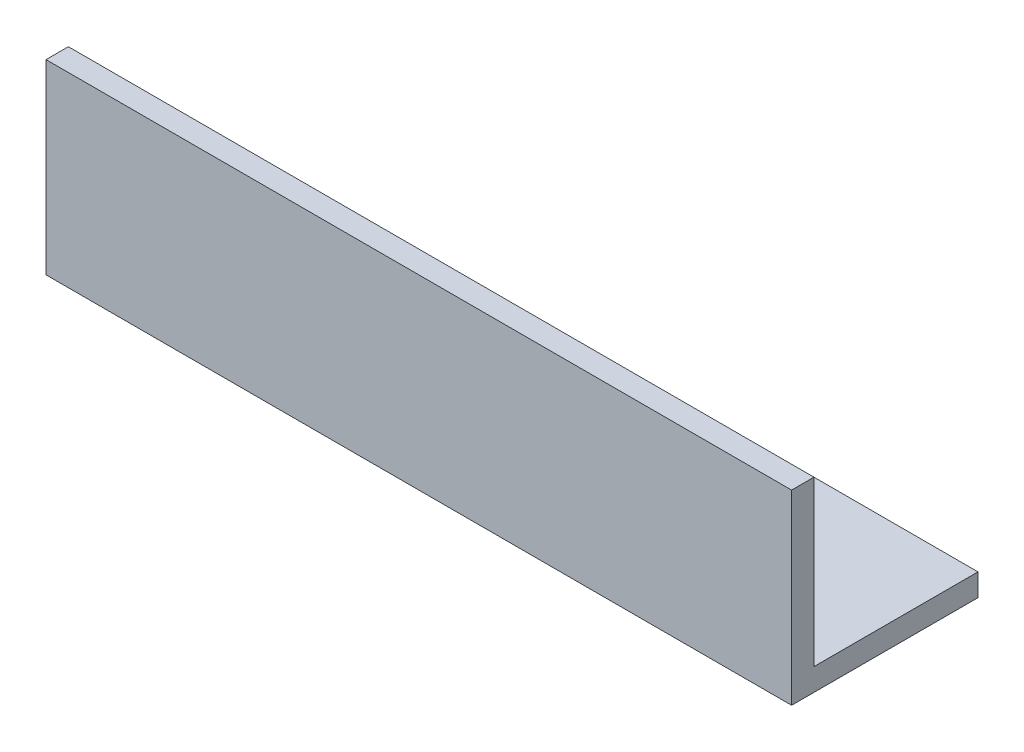
ISO-10303-21;
HEADER;
FILE_DESCRIPTION(('STEP AP214'),'2;1');
FILE_NAME('part.step','',(''),(''),'','','');
FILE_SCHEMA(('AUTOMOTIVE_DESIGN { 1 0 10303 214 1 1 1 1 }'));
ENDSEC;
DATA;
#1=APPLICATION_CONTEXT('core data for automotive mechanical design processes');
#2=APPLICATION_PROTOCOL_DEFINITION('international standard','automotive_design',2000,#1);
#3=PRODUCT_CONTEXT('',#1,'mechanical');
#4=PRODUCT('Part','Part','',(#3));
#5=PRODUCT_RELATED_PRODUCT_CATEGORY('part','',(#4));
#6=PRODUCT_DEFINITION_FORMATION('','',#4);
#7=PRODUCT_DEFINITION_CONTEXT('part definition',#1,'design');
#8=PRODUCT_DEFINITION('design','',#6,#7);
#9=PRODUCT_DEFINITION_SHAPE('','',#8);
#10=(LENGTH_UNIT() NAMED_UNIT(*) SI_UNIT(.MILLI.,.METRE.));
#11=(NAMED_UNIT(*) PLANE_ANGLE_UNIT() SI_UNIT($,.RADIAN.));
#12=(NAMED_UNIT(*) SI_UNIT($,.STERADIAN.) SOLID_ANGLE_UNIT());
#13=UNCERTAINTY_MEASURE_WITH_UNIT(LENGTH_MEASURE(1.E-05),#10,'distance_accuracy_value','');
#14=(GEOMETRIC_REPRESENTATION_CONTEXT(3) GLOBAL_UNCERTAINTY_ASSIGNED_CONTEXT((#13)) GLOBAL_UNIT_ASSIGNED_CONTEXT((#10,
#11,#12)) REPRESENTATION_CONTEXT('',''));
#15=CARTESIAN_POINT('',(0.,0.,0.));
#16=DIRECTION('',(0.,0.,1.));
#17=DIRECTION('',(1.,0.,0.));
#18=AXIS2_PLACEMENT_3D('',#15,#16,#17);
#19=CARTESIAN_POINT('',(100.,0.,0.));
#20=DIRECTION('',(0.,1.,0.));
#21=DIRECTION('',(0.,0.,1.));
#22=AXIS2_PLACEMENT_3D('',#19,#20,#21);
#23=PLANE('',#22);
#24=DIRECTION('',(0.,0.,-1.));
#25=VECTOR('',#24,1.);
#26=CARTESIAN_POINT('',(0.,0.,0.));
#27=LINE('',#26,#25);
#28=CARTESIAN_POINT('',(0.,0.,0.));
#29=VERTEX_POINT('',#28);
#30=CARTESIAN_POINT('',(0.,0.,-25.));
#31=VERTEX_POINT('',#30);
#32=EDGE_CURVE('E120',#29,#31,#27,.T.);
#33=ORIENTED_EDGE('',*,*,#32,.T.);
#34=DIRECTION('',(-1.,0.,0.));
#35=VECTOR('',#34,1.);
#36=CARTESIAN_POINT('',(100.,0.,-25.));
#37=LINE('',#36,#35);
#38=CARTESIAN_POINT('',(100.,0.,-25.));
#39=VERTEX_POINT('',#38);
#40=EDGE_CURVE('E11',#39,#31,#37,.T.);
#41=ORIENTED_EDGE('',*,*,#40,.F.);
#42=DIRECTION('',(0.,0.,-1.));
#43=VECTOR('',#42,1.);
#44=CARTESIAN_POINT('',(100.,0.,0.));
#45=LINE('',#44,#43);
#46=CARTESIAN_POINT('',(100.,0.,0.));
#47=VERTEX_POINT('',#46);
#48=EDGE_CURVE('E85',#47,#39,#45,.T.);
#49=ORIENTED_EDGE('',*,*,#48,.F.);
#50=DIRECTION('',(-1.,0.,0.));
#51=VECTOR('',#50,1.);
#52=CARTESIAN_POINT('',(100.,0.,0.));
#53=LINE('',#52,#51);
#54=EDGE_CURVE('E116',#47,#29,#53,.T.);
#55=ORIENTED_EDGE('',*,*,#54,.T.);
#56=EDGE_LOOP('',(#33,#41,#49,#55));
#57=FACE_BOUND('',#56,.T.);
#58=ADVANCED_FACE('F39',(#57),#23,.F.);
#59=CARTESIAN_POINT('',(100.,3.,-25.));
#60=DIRECTION('',(0.,0.,-1.));
#61=DIRECTION('',(-1.,0.,0.));
#62=AXIS2_PLACEMENT_3D('',#59,#60,#61);
#63=PLANE('',#62);
#64=DIRECTION('',(0.,-1.,0.));
#65=VECTOR('',#64,1.);
#66=CARTESIAN_POINT('',(0.,3.,-25.));
#67=LINE('',#66,#65);
#68=CARTESIAN_POINT('',(0.,3.,-25.));
#69=VERTEX_POINT('',#68);
#70=EDGE_CURVE('E123',#69,#31,#67,.T.);
#71=ORIENTED_EDGE('',*,*,#70,.F.);
#72=DIRECTION('',(-1.,0.,0.));
#73=VECTOR('',#72,1.);
#74=CARTESIAN_POINT('',(100.,3.,-25.));
#75=LINE('',#74,#73);
#76=CARTESIAN_POINT('',(100.,3.,-25.));
#77=VERTEX_POINT('',#76);
#78=EDGE_CURVE('E47',#77,#69,#75,.T.);
#79=ORIENTED_EDGE('',*,*,#78,.F.);
#80=DIRECTION('',(0.,-1.,0.));
#81=VECTOR('',#80,1.);
#82=CARTESIAN_POINT('',(100.,3.,-25.));
#83=LINE('',#82,#81);
#84=EDGE_CURVE('E212',#77,#39,#83,.T.);
#85=ORIENTED_EDGE('',*,*,#84,.T.);
#86=ORIENTED_EDGE('',*,*,#40,.T.);
#87=EDGE_LOOP('',(#71,#79,#85,#86));
#88=FACE_BOUND('',#87,.T.);
#89=ADVANCED_FACE('F142',(#88),#63,.T.);
#90=CARTESIAN_POINT('',(100.,3.,0.));
#91=DIRECTION('',(0.,1.,0.));
#92=DIRECTION('',(0.,0.,1.));
#93=AXIS2_PLACEMENT_3D('',#90,#91,#92);
#94=PLANE('',#93);
#95=DIRECTION('',(0.,0.,-1.));
#96=VECTOR('',#95,1.);
#97=CARTESIAN_POINT('',(0.,3.,0.));
#98=LINE('',#97,#96);
#99=CARTESIAN_POINT('',(0.,3.,-3.));
#100=VERTEX_POINT('',#99);
#101=EDGE_CURVE('E126',#100,#69,#98,.T.);
#102=ORIENTED_EDGE('',*,*,#101,.F.);
#103=DIRECTION('',(-1.,0.,0.));
#104=VECTOR('',#103,1.);
#105=CARTESIAN_POINT('',(100.,3.,-3.));
#106=LINE('',#105,#104);
#107=CARTESIAN_POINT('',(100.,3.,-3.));
#108=VERTEX_POINT('',#107);
#109=EDGE_CURVE('E106',#108,#100,#106,.T.);
#110=ORIENTED_EDGE('',*,*,#109,.F.);
#111=DIRECTION('',(0.,0.,-1.));
#112=VECTOR('',#111,1.);
#113=CARTESIAN_POINT('',(100.,3.,0.));
#114=LINE('',#113,#112);
#115=EDGE_CURVE('E112',#108,#77,#114,.T.);
#116=ORIENTED_EDGE('',*,*,#115,.T.);
#117=ORIENTED_EDGE('',*,*,#78,.T.);
#118=EDGE_LOOP('',(#102,#110,#116,#117));
#119=FACE_BOUND('',#118,.T.);
#120=ADVANCED_FACE('F139',(#119),#94,.T.);
#121=CARTESIAN_POINT('',(100.,25.,-3.));
#122=DIRECTION('',(0.,0.,-1.));
#123=DIRECTION('',(0.,1.,0.));
#124=AXIS2_PLACEMENT_3D('',#121,#122,#123);
#125=PLANE('',#124);
#126=DIRECTION('',(0.,-1.,0.));
#127=VECTOR('',#126,1.);
#128=CARTESIAN_POINT('',(0.,25.,-3.));
#129=LINE('',#128,#127);
#130=CARTESIAN_POINT('',(0.,25.,-3.));
#131=VERTEX_POINT('',#130);
#132=EDGE_CURVE('E101',#131,#100,#129,.T.);
#133=ORIENTED_EDGE('',*,*,#132,.F.);
#134=DIRECTION('',(-1.,0.,0.));
#135=VECTOR('',#134,1.);
#136=CARTESIAN_POINT('',(100.,25.,-3.));
#137=LINE('',#136,#135);
#138=CARTESIAN_POINT('',(100.,25.,-3.));
#139=VERTEX_POINT('',#138);
#140=EDGE_CURVE('E96',#139,#131,#137,.T.);
#141=ORIENTED_EDGE('',*,*,#140,.F.);
#142=DIRECTION('',(0.,-1.,0.));
#143=VECTOR('',#142,1.);
#144=CARTESIAN_POINT('',(100.,25.,-3.));
#145=LINE('',#144,#143);
#146=EDGE_CURVE('E99',#139,#108,#145,.T.);
#147=ORIENTED_EDGE('',*,*,#146,.T.);
#148=ORIENTED_EDGE('',*,*,#109,.T.);
#149=EDGE_LOOP('',(#133,#141,#147,#148));
#150=FACE_BOUND('',#149,.T.);
#151=ADVANCED_FACE('F98',(#150),#125,.T.);
#152=CARTESIAN_POINT('',(100.,25.,0.));
#153=DIRECTION('',(0.,1.,0.));
#154=DIRECTION('',(0.,0.,1.));
#155=AXIS2_PLACEMENT_3D('',#152,#153,#154);
#156=PLANE('',#155);
#157=DIRECTION('',(0.,0.,-1.));
#158=VECTOR('',#157,1.);
#159=CARTESIAN_POINT('',(0.,25.,0.));
#160=LINE('',#159,#158);
#161=CARTESIAN_POINT('',(0.,25.,0.));
#162=VERTEX_POINT('',#161);
#163=EDGE_CURVE('E130',#162,#131,#160,.T.);
#164=ORIENTED_EDGE('',*,*,#163,.F.);
#165=DIRECTION('',(-1.,0.,0.));
#166=VECTOR('',#165,1.);
#167=CARTESIAN_POINT('',(100.,25.,0.));
#168=LINE('',#167,#166);
#169=CARTESIAN_POINT('',(100.,25.,0.));
#170=VERTEX_POINT('',#169);
#171=EDGE_CURVE('E76',#170,#162,#168,.T.);
#172=ORIENTED_EDGE('',*,*,#171,.F.);
#173=DIRECTION('',(0.,0.,-1.));
#174=VECTOR('',#173,1.);
#175=CARTESIAN_POINT('',(100.,25.,0.));
#176=LINE('',#175,#174);
#177=EDGE_CURVE('E110',#170,#139,#176,.T.);
#178=ORIENTED_EDGE('',*,*,#177,.T.);
#179=ORIENTED_EDGE('',*,*,#140,.T.);
#180=EDGE_LOOP('',(#164,#172,#178,#179));
#181=FACE_BOUND('',#180,.T.);
#182=ADVANCED_FACE('F114',(#181),#156,.T.);
#183=CARTESIAN_POINT('',(100.,25.,0.));
#184=DIRECTION('',(0.,0.,-1.));
#185=DIRECTION('',(0.,1.,0.));
#186=AXIS2_PLACEMENT_3D('',#183,#184,#185);
#187=PLANE('',#186);
#188=DIRECTION('',(0.,-1.,0.));
#189=VECTOR('',#188,1.);
#190=CARTESIAN_POINT('',(0.,25.,0.));
#191=LINE('',#190,#189);
#192=EDGE_CURVE('E79',#162,#29,#191,.T.);
#193=ORIENTED_EDGE('',*,*,#192,.T.);
#194=ORIENTED_EDGE('',*,*,#54,.F.);
#195=DIRECTION('',(0.,-1.,0.));
#196=VECTOR('',#195,1.);
#197=CARTESIAN_POINT('',(100.,25.,0.));
#198=LINE('',#197,#196);
#199=EDGE_CURVE('E55',#170,#47,#198,.T.);
#200=ORIENTED_EDGE('',*,*,#199,.F.);
#201=ORIENTED_EDGE('',*,*,#171,.T.);
#202=EDGE_LOOP('',(#193,#194,#200,#201));
#203=FACE_BOUND('',#202,.T.);
#204=ADVANCED_FACE('F147',(#203),#187,.F.);
#205=CARTESIAN_POINT('',(100.,0.,0.));
#206=DIRECTION('',(-1.,0.,0.));
#207=DIRECTION('',(0.,0.,1.));
#208=AXIS2_PLACEMENT_3D('',#205,#206,#207);
#209=PLANE('',#208);
#210=ORIENTED_EDGE('',*,*,#48,.T.);
#211=ORIENTED_EDGE('',*,*,#84,.F.);
#212=ORIENTED_EDGE('',*,*,#115,.F.);
#213=ORIENTED_EDGE('',*,*,#146,.F.);
#214=ORIENTED_EDGE('',*,*,#177,.F.);
#215=ORIENTED_EDGE('',*,*,#199,.T.);
#216=EDGE_LOOP('',(#210,#211,#212,#213,#214,#215));
#217=FACE_BOUND('',#216,.T.);
#218=ADVANCED_FACE('F109',(#217),#209,.F.);
#219=CARTESIAN_POINT('',(0.,0.,0.));
#220=DIRECTION('',(-1.,0.,0.));
#221=DIRECTION('',(0.,0.,1.));
#222=AXIS2_PLACEMENT_3D('',#219,#220,#221);
#223=PLANE('',#222);
#224=ORIENTED_EDGE('',*,*,#32,.F.);
#225=ORIENTED_EDGE('',*,*,#192,.F.);
#226=ORIENTED_EDGE('',*,*,#163,.T.);
#227=ORIENTED_EDGE('',*,*,#132,.T.);
#228=ORIENTED_EDGE('',*,*,#101,.T.);
#229=ORIENTED_EDGE('',*,*,#70,.T.);
#230=EDGE_LOOP('',(#224,#225,#226,#227,#228,#229));
#231=FACE_BOUND('',#230,.T.);
#232=ADVANCED_FACE('F145',(#231),#223,.T.);
#233=CLOSED_SHELL('',(#58,#89,#120,#151,#182,#204,#218,#232));
#234=MANIFOLD_SOLID_BREP('B2',#233);
#235=ADVANCED_BREP_SHAPE_REPRESENTATION('',(#18,#234),#14);
#236=SHAPE_DEFINITION_REPRESENTATION(#9,#235);
ENDSEC;
END-ISO-10303-21;
